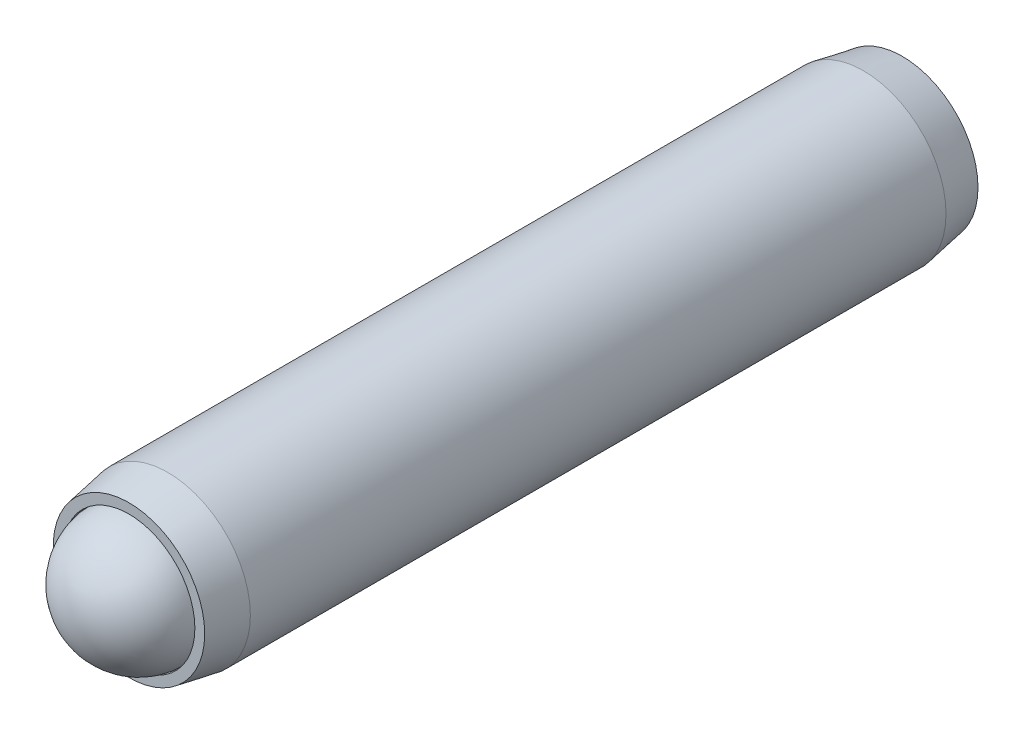
ISO-10303-21;
HEADER;
FILE_DESCRIPTION(('STEP AP214'),'2;1');
FILE_NAME('part.step','',(''),(''),'','','');
FILE_SCHEMA(('AUTOMOTIVE_DESIGN { 1 0 10303 214 1 1 1 1 }'));
ENDSEC;
DATA;
#1=APPLICATION_CONTEXT('core data for automotive mechanical design processes');
#2=APPLICATION_PROTOCOL_DEFINITION('international standard','automotive_design',2000,#1);
#3=PRODUCT_CONTEXT('',#1,'mechanical');
#4=PRODUCT('Part','Part','',(#3));
#5=PRODUCT_RELATED_PRODUCT_CATEGORY('part','',(#4));
#6=PRODUCT_DEFINITION_FORMATION('','',#4);
#7=PRODUCT_DEFINITION_CONTEXT('part definition',#1,'design');
#8=PRODUCT_DEFINITION('design','',#6,#7);
#9=PRODUCT_DEFINITION_SHAPE('','',#8);
#10=(LENGTH_UNIT() NAMED_UNIT(*) SI_UNIT(.MILLI.,.METRE.));
#11=(NAMED_UNIT(*) PLANE_ANGLE_UNIT() SI_UNIT($,.RADIAN.));
#12=(NAMED_UNIT(*) SI_UNIT($,.STERADIAN.) SOLID_ANGLE_UNIT());
#13=UNCERTAINTY_MEASURE_WITH_UNIT(LENGTH_MEASURE(1.E-05),#10,'distance_accuracy_value','');
#14=(GEOMETRIC_REPRESENTATION_CONTEXT(3) GLOBAL_UNCERTAINTY_ASSIGNED_CONTEXT((#13)) GLOBAL_UNIT_ASSIGNED_CONTEXT((#10,
#11,#12)) REPRESENTATION_CONTEXT('',''));
#15=CARTESIAN_POINT('',(0.,0.,0.));
#16=DIRECTION('',(0.,0.,1.));
#17=DIRECTION('',(1.,0.,0.));
#18=AXIS2_PLACEMENT_3D('',#15,#16,#17);
#19=CARTESIAN_POINT('',(0.,0.,14.));
#20=DIRECTION('',(0.,0.,-1.));
#21=DIRECTION('',(-1.,0.,0.));
#22=AXIS2_PLACEMENT_3D('',#19,#20,#21);
#23=CYLINDRICAL_SURFACE('',#22,2.991);
#24=CARTESIAN_POINT('',(0.,0.,12.5946563650987));
#25=DIRECTION('',(0.,0.,1.));
#26=DIRECTION('',(1.,0.,0.));
#27=AXIS2_PLACEMENT_3D('',#24,#25,#26);
#28=CIRCLE('',#27,2.991);
#29=CARTESIAN_POINT('',(2.991,0.,12.5946563650987));
#30=VERTEX_POINT('',#29);
#31=EDGE_CURVE('P0_E184',#30,#30,#28,.T.);
#32=ORIENTED_EDGE('',*,*,#31,.F.);
#33=EDGE_LOOP('',(#32));
#34=FACE_BOUND('',#33,.T.);
#35=CARTESIAN_POINT('',(0.,0.,-12.5946563650987));
#36=DIRECTION('',(0.,0.,1.));
#37=DIRECTION('',(1.,0.,0.));
#38=AXIS2_PLACEMENT_3D('',#35,#36,#37);
#39=CIRCLE('',#38,2.991);
#40=CARTESIAN_POINT('',(2.991,0.,-12.5946563650987));
#41=VERTEX_POINT('',#40);
#42=EDGE_CURVE('P0_E187',#41,#41,#39,.T.);
#43=ORIENTED_EDGE('',*,*,#42,.T.);
#44=EDGE_LOOP('',(#43));
#45=FACE_BOUND('',#44,.T.);
#46=ADVANCED_FACE('P0_F16',(#34,#45),#23,.T.);
#47=CARTESIAN_POINT('',(0.,0.,14.));
#48=DIRECTION('',(0.,0.,-1.));
#49=DIRECTION('',(-1.,0.,0.));
#50=AXIS2_PLACEMENT_3D('',#47,#48,#49);
#51=CONICAL_SURFACE('',#50,2.7432,0.174532925199427);
#52=ORIENTED_EDGE('',*,*,#31,.T.);
#53=EDGE_LOOP('',(#52));
#54=FACE_BOUND('',#53,.T.);
#55=CARTESIAN_POINT('',(0.,0.,14.));
#56=DIRECTION('',(0.,0.,1.));
#57=DIRECTION('',(1.,0.,0.));
#58=AXIS2_PLACEMENT_3D('',#55,#56,#57);
#59=CIRCLE('',#58,2.7432);
#60=CARTESIAN_POINT('',(2.7432,0.,14.));
#61=VERTEX_POINT('',#60);
#62=EDGE_CURVE('P0_E200',#61,#61,#59,.T.);
#63=ORIENTED_EDGE('',*,*,#62,.F.);
#64=EDGE_LOOP('',(#63));
#65=FACE_BOUND('',#64,.T.);
#66=ADVANCED_FACE('P0_F162',(#54,#65),#51,.T.);
#67=CARTESIAN_POINT('',(0.,0.,14.));
#68=DIRECTION('',(0.,0.,1.));
#69=DIRECTION('',(1.,0.,0.));
#70=AXIS2_PLACEMENT_3D('',#67,#68,#69);
#71=PLANE('',#70);
#72=CARTESIAN_POINT('',(0.,0.,14.));
#73=DIRECTION('',(0.,0.,1.));
#74=DIRECTION('',(1.,0.,0.));
#75=AXIS2_PLACEMENT_3D('',#72,#73,#74);
#76=CIRCLE('',#75,2.3876);
#77=CARTESIAN_POINT('',(2.3876,0.,14.));
#78=VERTEX_POINT('',#77);
#79=EDGE_CURVE('P0_E195',#78,#78,#76,.T.);
#80=ORIENTED_EDGE('',*,*,#79,.F.);
#81=EDGE_LOOP('',(#80));
#82=FACE_BOUND('',#81,.T.);
#83=ORIENTED_EDGE('',*,*,#62,.T.);
#84=EDGE_LOOP('',(#83));
#85=FACE_BOUND('',#84,.T.);
#86=ADVANCED_FACE('P0_F159',(#82,#85),#71,.T.);
#87=CARTESIAN_POINT('',(0.,0.,-12.5946563650987));
#88=DIRECTION('',(0.,0.,1.));
#89=DIRECTION('',(1.,0.,0.));
#90=AXIS2_PLACEMENT_3D('',#87,#88,#89);
#91=CONICAL_SURFACE('',#90,2.991,0.174532925199426);
#92=CARTESIAN_POINT('',(0.,0.,-14.));
#93=DIRECTION('',(0.,0.,1.));
#94=DIRECTION('',(1.,0.,0.));
#95=AXIS2_PLACEMENT_3D('',#92,#93,#94);
#96=CIRCLE('',#95,2.7432);
#97=CARTESIAN_POINT('',(2.7432,0.,-14.));
#98=VERTEX_POINT('',#97);
#99=EDGE_CURVE('P0_E189',#98,#98,#96,.T.);
#100=ORIENTED_EDGE('',*,*,#99,.T.);
#101=EDGE_LOOP('',(#100));
#102=FACE_BOUND('',#101,.T.);
#103=ORIENTED_EDGE('',*,*,#42,.F.);
#104=EDGE_LOOP('',(#103));
#105=FACE_BOUND('',#104,.T.);
#106=ADVANCED_FACE('P0_F161',(#102,#105),#91,.T.);
#107=CARTESIAN_POINT('',(0.,0.,-14.));
#108=DIRECTION('',(0.,0.,1.));
#109=DIRECTION('',(1.,0.,0.));
#110=AXIS2_PLACEMENT_3D('',#107,#108,#109);
#111=PLANE('',#110);
#112=CARTESIAN_POINT('',(0.,0.,-14.));
#113=DIRECTION('',(0.,0.,1.));
#114=DIRECTION('',(1.,0.,0.));
#115=AXIS2_PLACEMENT_3D('',#112,#113,#114);
#116=CIRCLE('',#115,1.14567944042316);
#117=CARTESIAN_POINT('',(0.572839720211583,-0.992187499999999,-14.));
#118=VERTEX_POINT('',#117);
#119=CARTESIAN_POINT('',(1.14567944042316,0.,-14.));
#120=VERTEX_POINT('',#119);
#121=EDGE_CURVE('P0_E19',#118,#120,#116,.T.);
#122=ORIENTED_EDGE('',*,*,#121,.T.);
#123=CARTESIAN_POINT('',(0.572839720211582,0.9921875,-14.));
#124=VERTEX_POINT('',#123);
#125=EDGE_CURVE('P0_E11',#120,#124,#116,.T.);
#126=ORIENTED_EDGE('',*,*,#125,.T.);
#127=CARTESIAN_POINT('',(-0.572839720211582,0.9921875,-14.));
#128=VERTEX_POINT('',#127);
#129=EDGE_CURVE('P0_E24',#124,#128,#116,.T.);
#130=ORIENTED_EDGE('',*,*,#129,.T.);
#131=CARTESIAN_POINT('',(0.,0.,-14.));
#132=DIRECTION('',(0.,0.,-1.));
#133=DIRECTION('',(-1.,0.,0.));
#134=AXIS2_PLACEMENT_3D('',#131,#132,#133);
#135=CIRCLE('',#134,1.14567944042316);
#136=CARTESIAN_POINT('',(-1.14567944042316,0.,-14.));
#137=VERTEX_POINT('',#136);
#138=EDGE_CURVE('P0_E77',#137,#128,#135,.T.);
#139=ORIENTED_EDGE('',*,*,#138,.F.);
#140=CARTESIAN_POINT('',(-0.572839720211581,-0.9921875,-14.));
#141=VERTEX_POINT('',#140);
#142=EDGE_CURVE('P0_E85',#137,#141,#116,.T.);
#143=ORIENTED_EDGE('',*,*,#142,.T.);
#144=EDGE_CURVE('P0_E90',#141,#118,#116,.T.);
#145=ORIENTED_EDGE('',*,*,#144,.T.);
#146=EDGE_LOOP('',(#122,#126,#130,#139,#143,#145));
#147=FACE_BOUND('',#146,.T.);
#148=ORIENTED_EDGE('',*,*,#99,.F.);
#149=EDGE_LOOP('',(#148));
#150=FACE_BOUND('',#149,.T.);
#151=ADVANCED_FACE('P0_F91',(#147,#150),#111,.F.);
#152=CARTESIAN_POINT('',(0.,0.,12.6644039545991));
#153=DIRECTION('',(0.,0.,1.));
#154=DIRECTION('',(1.,0.,0.));
#155=AXIS2_PLACEMENT_3D('',#152,#153,#154);
#156=CONICAL_SURFACE('',#155,2.3876,0.78539816339745);
#157=CARTESIAN_POINT('',(0.,0.,10.2768039545991));
#158=VERTEX_POINT('',#157);
#159=VERTEX_LOOP('',#158);
#160=FACE_BOUND('',#159,.T.);
#161=CARTESIAN_POINT('',(0.,0.,12.6644039545991));
#162=DIRECTION('',(0.,0.,1.));
#163=DIRECTION('',(1.,0.,0.));
#164=AXIS2_PLACEMENT_3D('',#161,#162,#163);
#165=CIRCLE('',#164,2.3876);
#166=CARTESIAN_POINT('',(2.3876,0.,12.6644039545991));
#167=VERTEX_POINT('',#166);
#168=EDGE_CURVE('P0_E190',#167,#167,#165,.T.);
#169=ORIENTED_EDGE('',*,*,#168,.T.);
#170=EDGE_LOOP('',(#169));
#171=FACE_BOUND('',#170,.T.);
#172=ADVANCED_FACE('P0_F165',(#160,#171),#156,.F.);
#173=CARTESIAN_POINT('',(0.,0.,14.));
#174=DIRECTION('',(0.,0.,1.));
#175=DIRECTION('',(1.,0.,0.));
#176=AXIS2_PLACEMENT_3D('',#173,#174,#175);
#177=CYLINDRICAL_SURFACE('',#176,2.3876);
#178=ORIENTED_EDGE('',*,*,#168,.F.);
#179=EDGE_LOOP('',(#178));
#180=FACE_BOUND('',#179,.T.);
#181=ORIENTED_EDGE('',*,*,#79,.T.);
#182=EDGE_LOOP('',(#181));
#183=FACE_BOUND('',#182,.T.);
#184=ADVANCED_FACE('P0_F132',(#180,#183),#177,.F.);
#185=CARTESIAN_POINT('',(0.,0.,-14.));
#186=DIRECTION('',(0.,0.,-1.));
#187=DIRECTION('',(-1.,0.,0.));
#188=AXIS2_PLACEMENT_3D('',#185,#186,#187);
#189=CONICAL_SURFACE('',#188,1.14567944042316,0.78539816339745);
#190=ORIENTED_EDGE('',*,*,#121,.F.);
#191=CARTESIAN_POINT('',(1.145794910477,0.000200000000000163,-14.000115487509));
#192=CARTESIAN_POINT('',(1.12609913995856,-0.0339140752321557,-13.9804328114047));
#193=CARTESIAN_POINT('',(1.10607402631377,-0.0685985894922794,-13.9619056845184));
#194=CARTESIAN_POINT('',(1.06524035596264,-0.139324581199959,-13.9279823296504));
#195=CARTESIAN_POINT('',(1.04442791197037,-0.175372791624242,-13.9126049872309));
#196=CARTESIAN_POINT('',(1.00246048249572,-0.248062511737395,-13.8862631427343));
#197=CARTESIAN_POINT('',(0.981316196707012,-0.284685489013201,-13.8752323965131));
#198=CARTESIAN_POINT('',(0.938562244623588,-0.358737506246056,-13.8582362056729));
#199=CARTESIAN_POINT('',(0.916953885244212,-0.396164282559342,-13.8522580675789));
#200=CARTESIAN_POINT('',(0.879714587318154,-0.46066463860547,-13.8468663449143));
#201=CARTESIAN_POINT('',(0.864132099442442,-0.487654299314529,-13.8460689963883));
#202=CARTESIAN_POINT('',(0.832997298779852,-0.541581355945663,-13.8474081933614));
#203=CARTESIAN_POINT('',(0.817444993408173,-0.568518739024239,-13.849545386137));
#204=CARTESIAN_POINT('',(0.771010163908484,-0.648946222958497,-13.860217571306));
#205=CARTESIAN_POINT('',(0.740358726795446,-0.702036069363282,-13.8730143807227));
#206=CARTESIAN_POINT('',(0.68656205513008,-0.795214637965797,-13.9038974676501));
#207=CARTESIAN_POINT('',(0.663164549602744,-0.835740306309516,-13.9203650089077));
#208=CARTESIAN_POINT('',(0.617285982385523,-0.915204315708206,-13.9574603835568));
#209=CARTESIAN_POINT('',(0.594802217831308,-0.954147338261523,-13.9780746806455));
#210=CARTESIAN_POINT('',(0.572724250157744,-0.992387499999999,-14.000115487509));
#211=B_SPLINE_CURVE_WITH_KNOTS('',3,(#191,#192,#193,#194,#195,#196,#197,#198,#199,#200,#201,
#202,#203,#204,#205,#206,#207,#208,#209,#210),.UNSPECIFIED.,.F.,.F.,(4,2,2,2,2,2,2,2,2,4),(0.,
0.13219718521019,0.265165186853262,0.396020097605669,0.526545281028574,0.619935205043264,
0.713345731536164,0.900220051846369,1.04884529769095,1.1969930355767),.UNSPECIFIED.);
#212=EDGE_CURVE('P0_E109',#120,#118,#211,.T.);
#213=ORIENTED_EDGE('',*,*,#212,.F.);
#214=EDGE_LOOP('',(#190,#213));
#215=FACE_BOUND('',#214,.T.);
#216=ADVANCED_FACE('P0_F127',(#215),#189,.F.);
#217=ORIENTED_EDGE('',*,*,#144,.F.);
#218=CARTESIAN_POINT('',(-1.14247621095534,-0.9921875,-14.3674920395338));
#219=CARTESIAN_POINT('',(-1.11465764817297,-0.9921875,-14.3464916393704));
#220=CARTESIAN_POINT('',(-1.08668408109739,-0.9921875,-14.3256971478216));
#221=CARTESIAN_POINT('',(-1.03036405380652,-0.9921875,-14.2846050377931));
#222=CARTESIAN_POINT('',(-1.00201750238008,-0.9921875,-14.2643075444585));
#223=CARTESIAN_POINT('',(-0.915909012474785,-0.9921875,-14.2039985075809));
#224=CARTESIAN_POINT('',(-0.85750119595752,-0.9921875,-14.16489385225));
#225=CARTESIAN_POINT('',(-0.735022281337406,-0.9921875,-14.0881267528187));
#226=CARTESIAN_POINT('',(-0.670818221979873,-0.9921875,-14.0506740310437));
#227=CARTESIAN_POINT('',(-0.539203244273796,-0.9921875,-13.9821650204898));
#228=CARTESIAN_POINT('',(-0.471804119013398,-0.9921875,-13.9510871682744));
#229=CARTESIAN_POINT('',(-0.370637445291612,-0.9921875,-13.91306629625));
#230=CARTESIAN_POINT('',(-0.338367677294405,-0.9921875,-13.9021540323464));
#231=CARTESIAN_POINT('',(-0.273049086298105,-0.9921875,-13.882920230113));
#232=CARTESIAN_POINT('',(-0.240000209797912,-0.9921875,-13.8745988702603));
#233=CARTESIAN_POINT('',(-0.17387839587922,-0.9921875,-13.8611187736932));
#234=CARTESIAN_POINT('',(-0.140816774783575,-0.9921875,-13.8559053939747));
#235=CARTESIAN_POINT('',(-0.0743291672741468,-0.9921875,-13.8487397124628));
#236=CARTESIAN_POINT('',(-0.0409031260707385,-0.9921875,-13.8467879080388));
#237=CARTESIAN_POINT('',(0.0247631140270446,-0.9921875,-13.8462934859037));
#238=CARTESIAN_POINT('',(0.0570024444112251,-0.9921875,-13.8476300314157));
#239=CARTESIAN_POINT('',(0.121194220405733,-0.9921875,-13.8533710432024));
#240=CARTESIAN_POINT('',(0.153146730267991,-0.9921875,-13.8577748040789));
#241=CARTESIAN_POINT('',(0.21709052455367,-0.9921875,-13.8694845111375));
#242=CARTESIAN_POINT('',(0.249072542042748,-0.9921875,-13.8768403024107));
#243=CARTESIAN_POINT('',(0.312337779646054,-0.9921875,-13.8940630913517));
#244=CARTESIAN_POINT('',(0.343621057993189,-0.9921875,-13.9039298788974));
#245=CARTESIAN_POINT('',(0.442112982998623,-0.9921875,-13.9387061115409));
#246=CARTESIAN_POINT('',(0.507919771037746,-0.9921875,-13.967576164078));
#247=CARTESIAN_POINT('',(0.636441890981751,-0.9921875,-14.0317652098148));
#248=CARTESIAN_POINT('',(0.699145053739844,-0.9921875,-14.0671073720824));
#249=CARTESIAN_POINT('',(0.818979829838883,-0.9921875,-14.1400213707045));
#250=CARTESIAN_POINT('',(0.876233471440128,-0.9921875,-14.1773951348683));
#251=CARTESIAN_POINT('',(0.9605851904894,-0.9921875,-14.2351711116989));
#252=CARTESIAN_POINT('',(0.988338378120949,-0.9921875,-14.254633487457));
#253=CARTESIAN_POINT('',(1.04346551309539,-0.9921875,-14.2940729815409));
#254=CARTESIAN_POINT('',(1.07083956207299,-0.9921875,-14.3140499576456));
#255=CARTESIAN_POINT('',(1.09805574489947,-0.9921875,-14.3342403053952));
#256=B_SPLINE_CURVE_WITH_KNOTS('',3,(#218,#219,#220,#221,#222,#223,#224,#225,#226,#227,#228,
#229,#230,#231,#232,#233,#234,#235,#236,#237,#238,#239,#240,#241,#242,#243,#244,#245,#246,#247,
#248,#249,#250,#251,#252,#253,#254,#255),.UNSPECIFIED.,.F.,.F.,(4,2,2,2,2,2,2,2,2,2,2,2,2,2,2,2,
2,2,4),(0.,0.104563127391605,0.209152318718919,0.419927099055485,0.642732653996012,
0.864771652302187,0.966879847198757,1.06899507437088,1.1692575299655,1.2695352735478,
1.36618351698525,1.4628095406014,1.56114078104352,1.65946379575192,1.87441437169281,
2.090150036015,2.29516517561955,2.39685303361284,2.4985130831926),.UNSPECIFIED.);
#257=EDGE_CURVE('P0_E107',#118,#141,#256,.F.);
#258=ORIENTED_EDGE('',*,*,#257,.F.);
#259=EDGE_LOOP('',(#217,#258));
#260=FACE_BOUND('',#259,.T.);
#261=ADVANCED_FACE('P0_F131',(#260),#189,.F.);
#262=ORIENTED_EDGE('',*,*,#142,.F.);
#263=CARTESIAN_POINT('',(-0.572724250157744,-0.9923875,-14.000115487509));
#264=CARTESIAN_POINT('',(-0.592420020676184,-0.958273424767844,-13.9804328114047));
#265=CARTESIAN_POINT('',(-0.612445134320978,-0.923588910507721,-13.9619056845184));
#266=CARTESIAN_POINT('',(-0.65327880467211,-0.852862918800041,-13.9279823296504));
#267=CARTESIAN_POINT('',(-0.674091248664374,-0.816814708375758,-13.9126049872309));
#268=CARTESIAN_POINT('',(-0.716058678139021,-0.744124988262605,-13.8862631427343));
#269=CARTESIAN_POINT('',(-0.737202963927733,-0.707502010986799,-13.8752323965131));
#270=CARTESIAN_POINT('',(-0.779956916011157,-0.633449993753944,-13.8582362056729));
#271=CARTESIAN_POINT('',(-0.801565275390533,-0.596023217440658,-13.8522580675789));
#272=CARTESIAN_POINT('',(-0.838804573316591,-0.53152286139453,-13.8468663449143));
#273=CARTESIAN_POINT('',(-0.854387061192303,-0.504533200685471,-13.8460689963883));
#274=CARTESIAN_POINT('',(-0.885521861854893,-0.450606144054337,-13.8474081933614));
#275=CARTESIAN_POINT('',(-0.901074167226572,-0.423668760975761,-13.849545386137));
#276=CARTESIAN_POINT('',(-0.94750899672626,-0.343241277041503,-13.860217571306));
#277=CARTESIAN_POINT('',(-0.978160433839299,-0.290151430636718,-13.8730143807227));
#278=CARTESIAN_POINT('',(-1.03195710550467,-0.196972862034203,-13.9038974676501));
#279=CARTESIAN_POINT('',(-1.055354611032,-0.156447193690484,-13.9203650089077));
#280=CARTESIAN_POINT('',(-1.10123317824922,-0.0769831842917931,-13.9574603835568));
#281=CARTESIAN_POINT('',(-1.12371694280344,-0.0380401617384769,-13.9780746806455));
#282=CARTESIAN_POINT('',(-1.145794910477,0.000199999999999656,-14.000115487509));
#283=B_SPLINE_CURVE_WITH_KNOTS('',3,(#263,#264,#265,#266,#267,#268,#269,#270,#271,#272,#273,
#274,#275,#276,#277,#278,#279,#280,#281,#282),.UNSPECIFIED.,.F.,.F.,(4,2,2,2,2,2,2,2,2,4),(0.,
0.132197185210189,0.265165186853262,0.396020097605669,0.526545281028573,0.619935205043264,
0.713345731536163,0.900220051846368,1.04884529769095,1.19699303557669),.UNSPECIFIED.);
#284=EDGE_CURVE('P0_E80',#141,#137,#283,.T.);
#285=ORIENTED_EDGE('',*,*,#284,.F.);
#286=EDGE_LOOP('',(#262,#285));
#287=FACE_BOUND('',#286,.T.);
#288=ADVANCED_FACE('P0_F86',(#287),#189,.F.);
#289=ORIENTED_EDGE('',*,*,#138,.T.);
#290=CARTESIAN_POINT('',(-1.145794910477,-0.000200000000000018,-14.000115487509));
#291=CARTESIAN_POINT('',(-1.12609913995856,0.0339140752321555,-13.9804328114047));
#292=CARTESIAN_POINT('',(-1.10607402631377,0.0685985894922789,-13.9619056845184));
#293=CARTESIAN_POINT('',(-1.06524035596264,0.139324581199958,-13.9279823296504));
#294=CARTESIAN_POINT('',(-1.04442791197037,0.175372791624241,-13.9126049872309));
#295=CARTESIAN_POINT('',(-1.00246048249572,0.248062511737395,-13.8862631427343));
#296=CARTESIAN_POINT('',(-0.981316196707012,0.284685489013201,-13.8752323965131));
#297=CARTESIAN_POINT('',(-0.938562244623588,0.358737506246056,-13.8582362056729));
#298=CARTESIAN_POINT('',(-0.916953885244213,0.396164282559342,-13.8522580675789));
#299=CARTESIAN_POINT('',(-0.879714587318154,0.46066463860547,-13.8468663449143));
#300=CARTESIAN_POINT('',(-0.864132099442442,0.487654299314528,-13.8460689963883));
#301=CARTESIAN_POINT('',(-0.832997298779853,0.541581355945663,-13.8474081933614));
#302=CARTESIAN_POINT('',(-0.817444993408173,0.568518739024238,-13.849545386137));
#303=CARTESIAN_POINT('',(-0.771010163908485,0.648946222958496,-13.860217571306));
#304=CARTESIAN_POINT('',(-0.740358726795446,0.702036069363281,-13.8730143807227));
#305=CARTESIAN_POINT('',(-0.68656205513008,0.795214637965796,-13.9038974676501));
#306=CARTESIAN_POINT('',(-0.663164549602745,0.835740306309516,-13.9203650089077));
#307=CARTESIAN_POINT('',(-0.617285982385523,0.915204315708207,-13.9574603835568));
#308=CARTESIAN_POINT('',(-0.594802217831308,0.954147338261523,-13.9780746806455));
#309=CARTESIAN_POINT('',(-0.572724250157744,0.9923875,-14.000115487509));
#310=B_SPLINE_CURVE_WITH_KNOTS('',3,(#290,#291,#292,#293,#294,#295,#296,#297,#298,#299,#300,
#301,#302,#303,#304,#305,#306,#307,#308,#309),.UNSPECIFIED.,.F.,.F.,(4,2,2,2,2,2,2,2,2,4),(0.,
0.132197185210189,0.265165186853262,0.396020097605669,0.526545281028573,0.619935205043263,
0.713345731536163,0.900220051846368,1.04884529769095,1.1969930355767),.UNSPECIFIED.);
#311=EDGE_CURVE('P0_E73',#137,#128,#310,.T.);
#312=ORIENTED_EDGE('',*,*,#311,.F.);
#313=EDGE_LOOP('',(#289,#312));
#314=FACE_BOUND('',#313,.T.);
#315=ADVANCED_FACE('P0_F75',(#314),#189,.F.);
#316=ORIENTED_EDGE('',*,*,#129,.F.);
#317=CARTESIAN_POINT('',(-1.14247621078911,0.9921875,-14.3674920394083));
#318=CARTESIAN_POINT('',(-1.11465764801141,0.9921875,-14.3464916392497));
#319=CARTESIAN_POINT('',(-1.08668408094051,0.9921875,-14.3256971477058));
#320=CARTESIAN_POINT('',(-1.03036405365904,0.9921875,-14.2846050376869));
#321=CARTESIAN_POINT('',(-1.00201750223733,0.9921875,-14.2643075443571));
#322=CARTESIAN_POINT('',(-0.915909012346497,0.9921875,-14.2039985074939));
#323=CARTESIAN_POINT('',(-0.857501195839066,0.9921875,-14.1648938521726));
#324=CARTESIAN_POINT('',(-0.735022281240403,0.9921875,-14.0881267527611));
#325=CARTESIAN_POINT('',(-0.670818221894542,0.9921875,-14.0506740309963));
#326=CARTESIAN_POINT('',(-0.539203244212802,0.9921875,-13.982165020461));
#327=CARTESIAN_POINT('',(-0.471804118965061,0.9921875,-13.9510871682543));
#328=CARTESIAN_POINT('',(-0.370637445252797,0.9921875,-13.9130662962363));
#329=CARTESIAN_POINT('',(-0.338367677251603,0.9921875,-13.9021540323325));
#330=CARTESIAN_POINT('',(-0.273049086247197,0.9921875,-13.8829202300993));
#331=CARTESIAN_POINT('',(-0.240000209742886,0.9921875,-13.8745988702472));
#332=CARTESIAN_POINT('',(-0.173878395816094,0.9921875,-13.8611187736821));
#333=CARTESIAN_POINT('',(-0.14081677471647,0.9921875,-13.8559053939651));
#334=CARTESIAN_POINT('',(-0.0743291671992145,0.9921875,-13.8487397124571));
#335=CARTESIAN_POINT('',(-0.0409031259919579,0.9921875,-13.8467879080354));
#336=CARTESIAN_POINT('',(0.0247631141129247,0.9921875,-13.8462934859057));
#337=CARTESIAN_POINT('',(0.0570024445003663,0.9921875,-13.8476300314208));
#338=CARTESIAN_POINT('',(0.12119422050107,0.9921875,-13.8533710432138));
#339=CARTESIAN_POINT('',(0.153146730366262,0.9921875,-13.8577748040939));
#340=CARTESIAN_POINT('',(0.217090524657736,0.9921875,-13.8694845111597));
#341=CARTESIAN_POINT('',(0.249072542149664,0.9921875,-13.8768403024366));
#342=CARTESIAN_POINT('',(0.312337779758396,0.9921875,-13.8940630913854));
#343=CARTESIAN_POINT('',(0.343621058108105,0.9921875,-13.903929878935));
#344=CARTESIAN_POINT('',(0.442112983138562,0.9921875,-13.9387061115969));
#345=CARTESIAN_POINT('',(0.507919771198879,0.9921875,-13.9675761641508));
#346=CARTESIAN_POINT('',(0.636441891183644,0.9921875,-14.0317652099233));
#347=CARTESIAN_POINT('',(0.699145053961294,0.9921875,-14.0671073722097));
#348=CARTESIAN_POINT('',(0.818979830095494,0.9921875,-14.1400213708677));
#349=CARTESIAN_POINT('',(0.876233471712468,0.9921875,-14.1773951350485));
#350=CARTESIAN_POINT('',(0.960585190784998,0.9921875,-14.2351711119045));
#351=CARTESIAN_POINT('',(0.988338378424188,0.9921875,-14.254633487671));
#352=CARTESIAN_POINT('',(1.04346551341387,0.9921875,-14.2940729817717));
#353=CARTESIAN_POINT('',(1.07083956239906,0.9921875,-14.3140499578848));
#354=CARTESIAN_POINT('',(1.09805574523311,0.9921875,-14.3342403056427));
#355=B_SPLINE_CURVE_WITH_KNOTS('',3,(#317,#318,#319,#320,#321,#322,#323,#324,#325,#326,#327,
#328,#329,#330,#331,#332,#333,#334,#335,#336,#337,#338,#339,#340,#341,#342,#343,#344,#345,#346,
#347,#348,#349,#350,#351,#352,#353,#354),.UNSPECIFIED.,.F.,.F.,(4,2,2,2,2,2,2,2,2,2,2,2,2,2,2,2,
2,2,4),(0.,0.104563127371703,0.209152318679107,0.419927098975113,0.642732653870156,
0.864771652131277,0.966879847039379,1.06899507422301,1.16925752982867,1.26953527342201,
1.36618351686957,1.46280954049584,1.56114078094885,1.65946379566813,1.87441437168727,
2.09015003608822,2.29516517576016,2.39685303378669,2.49851308339968),.UNSPECIFIED.);
#356=EDGE_CURVE('P0_E81',#128,#124,#355,.T.);
#357=ORIENTED_EDGE('',*,*,#356,.F.);
#358=EDGE_LOOP('',(#316,#357));
#359=FACE_BOUND('',#358,.T.);
#360=ADVANCED_FACE('P0_F231',(#359),#189,.F.);
#361=ORIENTED_EDGE('',*,*,#125,.F.);
#362=CARTESIAN_POINT('',(0.572724250157744,0.9923875,-14.000115487509));
#363=CARTESIAN_POINT('',(0.592420020676184,0.958273424767844,-13.9804328114047));
#364=CARTESIAN_POINT('',(0.612445134320978,0.923588910507721,-13.9619056845184));
#365=CARTESIAN_POINT('',(0.65327880467211,0.852862918800042,-13.9279823296504));
#366=CARTESIAN_POINT('',(0.674091248664374,0.816814708375758,-13.9126049872309));
#367=CARTESIAN_POINT('',(0.716058678139022,0.744124988262605,-13.8862631427343));
#368=CARTESIAN_POINT('',(0.737202963927734,0.707502010986799,-13.8752323965131));
#369=CARTESIAN_POINT('',(0.779956916011157,0.633449993753944,-13.8582362056729));
#370=CARTESIAN_POINT('',(0.801565275390533,0.596023217440658,-13.8522580675789));
#371=CARTESIAN_POINT('',(0.838804573316592,0.53152286139453,-13.8468663449143));
#372=CARTESIAN_POINT('',(0.854387061192303,0.504533200685472,-13.8460689963883));
#373=CARTESIAN_POINT('',(0.885521861854893,0.450606144054337,-13.8474081933614));
#374=CARTESIAN_POINT('',(0.901074167226572,0.423668760975762,-13.849545386137));
#375=CARTESIAN_POINT('',(0.94750899672626,0.343241277041504,-13.860217571306));
#376=CARTESIAN_POINT('',(0.978160433839299,0.290151430636718,-13.8730143807227));
#377=CARTESIAN_POINT('',(1.03195710550467,0.196972862034203,-13.9038974676501));
#378=CARTESIAN_POINT('',(1.055354611032,0.156447193690484,-13.9203650089077));
#379=CARTESIAN_POINT('',(1.10123317824922,0.0769831842917928,-13.9574603835568));
#380=CARTESIAN_POINT('',(1.12371694280344,0.0380401617384764,-13.9780746806455));
#381=CARTESIAN_POINT('',(1.145794910477,-0.000200000000000295,-14.000115487509));
#382=B_SPLINE_CURVE_WITH_KNOTS('',3,(#362,#363,#364,#365,#366,#367,#368,#369,#370,#371,#372,
#373,#374,#375,#376,#377,#378,#379,#380,#381),.UNSPECIFIED.,.F.,.F.,(4,2,2,2,2,2,2,2,2,4),(0.,
0.132197185210189,0.265165186853262,0.396020097605669,0.526545281028573,0.619935205043264,
0.713345731536163,0.900220051846368,1.04884529769095,1.1969930355767),.UNSPECIFIED.);
#383=EDGE_CURVE('P0_E94',#124,#120,#382,.T.);
#384=ORIENTED_EDGE('',*,*,#383,.F.);
#385=EDGE_LOOP('',(#361,#384));
#386=FACE_BOUND('',#385,.T.);
#387=ADVANCED_FACE('P0_F134',(#386),#189,.F.);
#388=CARTESIAN_POINT('',(0.,0.,-10.952));
#389=DIRECTION('',(0.,0.,-1.));
#390=DIRECTION('',(-1.,0.,0.));
#391=AXIS2_PLACEMENT_3D('',#388,#389,#390);
#392=PLANE('',#391);
#393=DIRECTION('',(1.,0.,0.));
#394=VECTOR('',#393,1.);
#395=CARTESIAN_POINT('',(-0.572839720211582,0.9921875,-10.952));
#396=LINE('',#395,#394);
#397=CARTESIAN_POINT('',(-0.572839720211582,0.9921875,-10.952));
#398=VERTEX_POINT('',#397);
#399=CARTESIAN_POINT('',(0.572839720211582,0.9921875,-10.952));
#400=VERTEX_POINT('',#399);
#401=EDGE_CURVE('P0_E203',#398,#400,#396,.T.);
#402=ORIENTED_EDGE('',*,*,#401,.T.);
#403=DIRECTION('',(0.5,-0.866025403784439,0.));
#404=VECTOR('',#403,1.);
#405=CARTESIAN_POINT('',(0.572839720211582,0.9921875,-10.952));
#406=LINE('',#405,#404);
#407=CARTESIAN_POINT('',(1.14567944042316,0.,-10.952));
#408=VERTEX_POINT('',#407);
#409=EDGE_CURVE('P0_E206',#400,#408,#406,.T.);
#410=ORIENTED_EDGE('',*,*,#409,.T.);
#411=DIRECTION('',(-0.5,-0.866025403784438,0.));
#412=VECTOR('',#411,1.);
#413=CARTESIAN_POINT('',(1.14567944042316,0.,-10.952));
#414=LINE('',#413,#412);
#415=CARTESIAN_POINT('',(0.572839720211582,-0.9921875,-10.952));
#416=VERTEX_POINT('',#415);
#417=EDGE_CURVE('P0_E209',#408,#416,#414,.T.);
#418=ORIENTED_EDGE('',*,*,#417,.T.);
#419=DIRECTION('',(-1.,0.,0.));
#420=VECTOR('',#419,1.);
#421=CARTESIAN_POINT('',(0.572839720211582,-0.9921875,-10.952));
#422=LINE('',#421,#420);
#423=CARTESIAN_POINT('',(-0.572839720211582,-0.9921875,-10.952));
#424=VERTEX_POINT('',#423);
#425=EDGE_CURVE('P0_E212',#416,#424,#422,.T.);
#426=ORIENTED_EDGE('',*,*,#425,.T.);
#427=DIRECTION('',(-0.5,0.866025403784439,0.));
#428=VECTOR('',#427,1.);
#429=CARTESIAN_POINT('',(-0.572839720211582,-0.9921875,-10.952));
#430=LINE('',#429,#428);
#431=CARTESIAN_POINT('',(-1.14567944042316,0.,-10.952));
#432=VERTEX_POINT('',#431);
#433=EDGE_CURVE('P0_E215',#424,#432,#430,.T.);
#434=ORIENTED_EDGE('',*,*,#433,.T.);
#435=DIRECTION('',(0.5,0.866025403784439,0.));
#436=VECTOR('',#435,1.);
#437=CARTESIAN_POINT('',(-1.14567944042316,0.,-10.952));
#438=LINE('',#437,#436);
#439=EDGE_CURVE('P0_E99',#432,#398,#438,.T.);
#440=ORIENTED_EDGE('',*,*,#439,.T.);
#441=EDGE_LOOP('',(#402,#410,#418,#426,#434,#440));
#442=FACE_BOUND('',#441,.T.);
#443=ADVANCED_FACE('P0_F240',(#442),#392,.T.);
#444=CARTESIAN_POINT('',(0.572839720211582,0.9921875,-10.952));
#445=DIRECTION('',(0.866025403784439,0.5,0.));
#446=DIRECTION('',(-0.5,0.866025403784439,0.));
#447=AXIS2_PLACEMENT_3D('',#444,#445,#446);
#448=PLANE('',#447);
#449=DIRECTION('',(0.,0.,-1.));
#450=VECTOR('',#449,1.);
#451=CARTESIAN_POINT('',(0.572839720211582,0.9921875,-10.952));
#452=LINE('',#451,#450);
#453=EDGE_CURVE('P0_E218',#400,#124,#452,.T.);
#454=ORIENTED_EDGE('',*,*,#453,.T.);
#455=ORIENTED_EDGE('',*,*,#383,.T.);
#456=DIRECTION('',(0.,0.,-1.));
#457=VECTOR('',#456,1.);
#458=CARTESIAN_POINT('',(1.14567944042316,0.,-10.952));
#459=LINE('',#458,#457);
#460=EDGE_CURVE('P0_E224',#408,#120,#459,.T.);
#461=ORIENTED_EDGE('',*,*,#460,.F.);
#462=ORIENTED_EDGE('',*,*,#409,.F.);
#463=EDGE_LOOP('',(#454,#455,#461,#462));
#464=FACE_BOUND('',#463,.T.);
#465=ADVANCED_FACE('P0_F155',(#464),#448,.F.);
#466=CARTESIAN_POINT('',(-0.572839720211582,0.9921875,-10.952));
#467=DIRECTION('',(0.,1.,0.));
#468=DIRECTION('',(0.,0.,1.));
#469=AXIS2_PLACEMENT_3D('',#466,#467,#468);
#470=PLANE('',#469);
#471=DIRECTION('',(0.,0.,-1.));
#472=VECTOR('',#471,1.);
#473=CARTESIAN_POINT('',(-0.572839720211582,0.9921875,-10.952));
#474=LINE('',#473,#472);
#475=EDGE_CURVE('P0_E37',#398,#128,#474,.T.);
#476=ORIENTED_EDGE('',*,*,#475,.T.);
#477=ORIENTED_EDGE('',*,*,#356,.T.);
#478=ORIENTED_EDGE('',*,*,#453,.F.);
#479=ORIENTED_EDGE('',*,*,#401,.F.);
#480=EDGE_LOOP('',(#476,#477,#478,#479));
#481=FACE_BOUND('',#480,.T.);
#482=ADVANCED_FACE('P0_F151',(#481),#470,.F.);
#483=CARTESIAN_POINT('',(-1.14567944042316,0.,-10.952));
#484=DIRECTION('',(-0.866025403784439,0.5,0.));
#485=DIRECTION('',(-0.5,-0.866025403784439,0.));
#486=AXIS2_PLACEMENT_3D('',#483,#484,#485);
#487=PLANE('',#486);
#488=DIRECTION('',(0.,0.,-1.));
#489=VECTOR('',#488,1.);
#490=CARTESIAN_POINT('',(-1.14567944042316,0.,-10.952));
#491=LINE('',#490,#489);
#492=EDGE_CURVE('P0_E96',#432,#137,#491,.T.);
#493=ORIENTED_EDGE('',*,*,#492,.T.);
#494=ORIENTED_EDGE('',*,*,#311,.T.);
#495=ORIENTED_EDGE('',*,*,#475,.F.);
#496=ORIENTED_EDGE('',*,*,#439,.F.);
#497=EDGE_LOOP('',(#493,#494,#495,#496));
#498=FACE_BOUND('',#497,.T.);
#499=ADVANCED_FACE('P0_F97',(#498),#487,.F.);
#500=CARTESIAN_POINT('',(-0.572839720211582,-0.9921875,-10.952));
#501=DIRECTION('',(-0.866025403784439,-0.5,0.));
#502=DIRECTION('',(0.5,-0.866025403784439,0.));
#503=AXIS2_PLACEMENT_3D('',#500,#501,#502);
#504=PLANE('',#503);
#505=DIRECTION('',(0.,0.,-1.));
#506=VECTOR('',#505,1.);
#507=CARTESIAN_POINT('',(-0.572839720211582,-0.9921875,-10.952));
#508=LINE('',#507,#506);
#509=EDGE_CURVE('P0_E103',#424,#141,#508,.T.);
#510=ORIENTED_EDGE('',*,*,#509,.T.);
#511=ORIENTED_EDGE('',*,*,#284,.T.);
#512=ORIENTED_EDGE('',*,*,#492,.F.);
#513=ORIENTED_EDGE('',*,*,#433,.F.);
#514=EDGE_LOOP('',(#510,#511,#512,#513));
#515=FACE_BOUND('',#514,.T.);
#516=ADVANCED_FACE('P0_F105',(#515),#504,.F.);
#517=CARTESIAN_POINT('',(0.572839720211582,-0.9921875,-10.952));
#518=DIRECTION('',(0.,-1.,0.));
#519=DIRECTION('',(1.,0.,0.));
#520=AXIS2_PLACEMENT_3D('',#517,#518,#519);
#521=PLANE('',#520);
#522=DIRECTION('',(0.,0.,-1.));
#523=VECTOR('',#522,1.);
#524=CARTESIAN_POINT('',(0.572839720211582,-0.9921875,-10.952));
#525=LINE('',#524,#523);
#526=EDGE_CURVE('P0_E221',#416,#118,#525,.T.);
#527=ORIENTED_EDGE('',*,*,#526,.T.);
#528=ORIENTED_EDGE('',*,*,#257,.T.);
#529=ORIENTED_EDGE('',*,*,#509,.F.);
#530=ORIENTED_EDGE('',*,*,#425,.F.);
#531=EDGE_LOOP('',(#527,#528,#529,#530));
#532=FACE_BOUND('',#531,.T.);
#533=ADVANCED_FACE('P0_F242',(#532),#521,.F.);
#534=CARTESIAN_POINT('',(1.14567944042316,0.,-10.952));
#535=DIRECTION('',(0.866025403784438,-0.5,0.));
#536=DIRECTION('',(0.5,0.866025403784439,0.));
#537=AXIS2_PLACEMENT_3D('',#534,#535,#536);
#538=PLANE('',#537);
#539=ORIENTED_EDGE('',*,*,#460,.T.);
#540=ORIENTED_EDGE('',*,*,#212,.T.);
#541=ORIENTED_EDGE('',*,*,#526,.F.);
#542=ORIENTED_EDGE('',*,*,#417,.F.);
#543=EDGE_LOOP('',(#539,#540,#541,#542));
#544=FACE_BOUND('',#543,.T.);
#545=ADVANCED_FACE('P0_F237',(#544),#538,.F.);
#546=CLOSED_SHELL('',(#46,#66,#86,#106,#151,#172,#184,#216,#261,#288,#315,#360,#387,#443,#465,
#482,#499,#516,#533,#545));
#547=MANIFOLD_SOLID_BREP('P0_B1',#546);
#548=CARTESIAN_POINT('',(0.,0.,13.6444));
#549=DIRECTION('',(0.,1.,0.));
#550=DIRECTION('',(1.,0.,0.));
#551=AXIS2_PLACEMENT_3D('',#548,#549,#550);
#552=SPHERICAL_SURFACE('',#551,2.38125);
#553=CARTESIAN_POINT('',(0.,0.,13.6444));
#554=DIRECTION('',(0.,0.,-1.));
#555=DIRECTION('',(1.,0.,0.));
#556=AXIS2_PLACEMENT_3D('',#553,#554,#555);
#557=SPHERICAL_SURFACE('',#556,2.38125);
#558=CARTESIAN_POINT('',(0.,0.,13.6444));
#559=DIRECTION('',(0.,0.,-1.));
#560=DIRECTION('',(1.,0.,0.));
#561=AXIS2_PLACEMENT_3D('',#558,#559,#560);
#562=CIRCLE('',#561,2.38125);
#563=CARTESIAN_POINT('',(2.38125,0.,13.6444));
#564=VERTEX_POINT('',#563);
#565=EDGE_CURVE('P1_E9',#564,#564,#562,.T.);
#566=ORIENTED_EDGE('',*,*,#565,.T.);
#567=EDGE_LOOP('',(#566));
#568=FACE_BOUND('',#567,.T.);
#569=ADVANCED_FACE('P1_F13',(#568),#557,.T.);
#570=CARTESIAN_POINT('',(0.,0.,13.6444));
#571=DIRECTION('',(0.,0.,-1.));
#572=DIRECTION('',(1.,0.,0.));
#573=AXIS2_PLACEMENT_3D('',#570,#571,#572);
#574=SPHERICAL_SURFACE('',#573,2.38125);
#575=ORIENTED_EDGE('',*,*,#565,.F.);
#576=EDGE_LOOP('',(#575));
#577=FACE_BOUND('',#576,.T.);
#578=ADVANCED_FACE('P1_F15',(#577),#574,.T.);
#579=CLOSED_SHELL('',(#569,#578));
#580=MANIFOLD_SOLID_BREP('P1_B1',#579);
#581=ADVANCED_BREP_SHAPE_REPRESENTATION('',(#18,#547,#580),#14);
#582=SHAPE_DEFINITION_REPRESENTATION(#9,#581);
ENDSEC;
END-ISO-10303-21;
